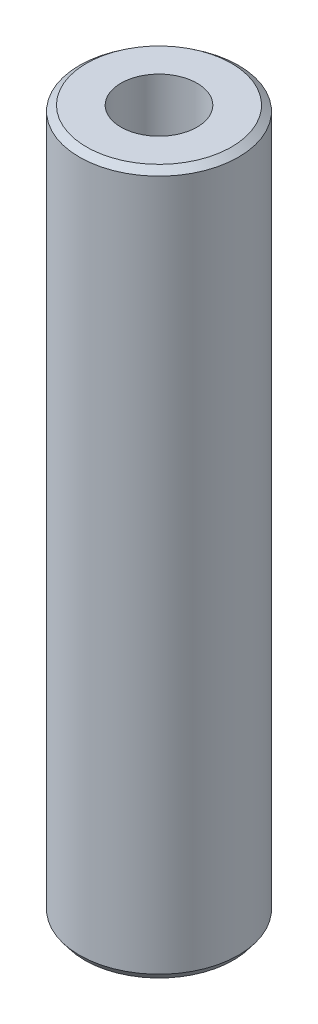
ISO-10303-21;
HEADER;
FILE_DESCRIPTION(('STEP AP214'),'2;1');
FILE_NAME('part.step','',(''),(''),'','','');
FILE_SCHEMA(('AUTOMOTIVE_DESIGN { 1 0 10303 214 1 1 1 1 }'));
ENDSEC;
DATA;
#1=APPLICATION_CONTEXT('core data for automotive mechanical design processes');
#2=APPLICATION_PROTOCOL_DEFINITION('international standard','automotive_design',2000,#1);
#3=PRODUCT_CONTEXT('',#1,'mechanical');
#4=PRODUCT('Part','Part','',(#3));
#5=PRODUCT_RELATED_PRODUCT_CATEGORY('part','',(#4));
#6=PRODUCT_DEFINITION_FORMATION('','',#4);
#7=PRODUCT_DEFINITION_CONTEXT('part definition',#1,'design');
#8=PRODUCT_DEFINITION('design','',#6,#7);
#9=PRODUCT_DEFINITION_SHAPE('','',#8);
#10=(LENGTH_UNIT() NAMED_UNIT(*) SI_UNIT(.MILLI.,.METRE.));
#11=(NAMED_UNIT(*) PLANE_ANGLE_UNIT() SI_UNIT($,.RADIAN.));
#12=(NAMED_UNIT(*) SI_UNIT($,.STERADIAN.) SOLID_ANGLE_UNIT());
#13=UNCERTAINTY_MEASURE_WITH_UNIT(LENGTH_MEASURE(1.E-05),#10,'distance_accuracy_value','');
#14=(GEOMETRIC_REPRESENTATION_CONTEXT(3) GLOBAL_UNCERTAINTY_ASSIGNED_CONTEXT((#13)) GLOBAL_UNIT_ASSIGNED_CONTEXT((#10,
#11,#12)) REPRESENTATION_CONTEXT('',''));
#15=CARTESIAN_POINT('',(0.,0.,0.));
#16=DIRECTION('',(0.,0.,1.));
#17=DIRECTION('',(1.,0.,0.));
#18=AXIS2_PLACEMENT_3D('',#15,#16,#17);
#19=CARTESIAN_POINT('',(0.,508.532402308355,0.));
#20=DIRECTION('',(0.,-1.,0.));
#21=DIRECTION('',(0.,0.,-1.));
#22=AXIS2_PLACEMENT_3D('',#19,#20,#21);
#23=CYLINDRICAL_SURFACE('',#22,57.5);
#24=CARTESIAN_POINT('',(0.,504.717653119941,0.));
#25=DIRECTION('',(0.,1.,0.));
#26=DIRECTION('',(0.,0.,1.));
#27=AXIS2_PLACEMENT_3D('',#24,#25,#26);
#28=CIRCLE('',#27,57.5);
#29=CARTESIAN_POINT('',(0.,504.717653119941,-57.5000000000001));
#30=VERTEX_POINT('',#29);
#31=EDGE_CURVE('E50',#30,#30,#28,.F.);
#32=ORIENTED_EDGE('',*,*,#31,.T.);
#33=EDGE_LOOP('',(#32));
#34=FACE_BOUND('',#33,.T.);
#35=CARTESIAN_POINT('',(0.,5.07228800096171,0.));
#36=DIRECTION('',(0.,1.,0.));
#37=DIRECTION('',(0.,0.,1.));
#38=AXIS2_PLACEMENT_3D('',#35,#36,#37);
#39=CIRCLE('',#38,57.5);
#40=CARTESIAN_POINT('',(0.,5.07228800096171,57.5));
#41=VERTEX_POINT('',#40);
#42=EDGE_CURVE('E51',#41,#41,#39,.T.);
#43=ORIENTED_EDGE('',*,*,#42,.T.);
#44=EDGE_LOOP('',(#43));
#45=FACE_BOUND('',#44,.T.);
#46=ADVANCED_FACE('F39',(#34,#45),#23,.T.);
#47=CARTESIAN_POINT('',(0.,508.532402308355,0.));
#48=DIRECTION('',(0.,1.,0.));
#49=DIRECTION('',(0.,0.,1.));
#50=AXIS2_PLACEMENT_3D('',#47,#48,#49);
#51=PLANE('',#50);
#52=CARTESIAN_POINT('',(0.,508.532402308355,0.));
#53=DIRECTION('',(0.,1.,0.));
#54=DIRECTION('',(0.,0.,1.));
#55=AXIS2_PLACEMENT_3D('',#52,#53,#54);
#56=CIRCLE('',#55,52.4277119990382);
#57=CARTESIAN_POINT('',(0.,508.532402308355,-52.4277119990383));
#58=VERTEX_POINT('',#57);
#59=EDGE_CURVE('E54',#58,#58,#56,.T.);
#60=ORIENTED_EDGE('',*,*,#59,.T.);
#61=EDGE_LOOP('',(#60));
#62=FACE_BOUND('',#61,.T.);
#63=CARTESIAN_POINT('',(0.,508.532402308355,0.));
#64=DIRECTION('',(0.,1.,0.));
#65=DIRECTION('',(0.,0.,1.));
#66=AXIS2_PLACEMENT_3D('',#63,#64,#65);
#67=CIRCLE('',#66,27.5376309982399);
#68=CARTESIAN_POINT('',(0.,508.532402308355,27.5376309982399));
#69=VERTEX_POINT('',#68);
#70=EDGE_CURVE('E58',#69,#69,#67,.T.);
#71=ORIENTED_EDGE('',*,*,#70,.F.);
#72=EDGE_LOOP('',(#71));
#73=FACE_BOUND('',#72,.T.);
#74=ADVANCED_FACE('F69',(#62,#73),#51,.T.);
#75=CARTESIAN_POINT('',(0.,0.,0.));
#76=DIRECTION('',(0.,1.,0.));
#77=DIRECTION('',(0.,0.,1.));
#78=AXIS2_PLACEMENT_3D('',#75,#76,#77);
#79=PLANE('',#78);
#80=CARTESIAN_POINT('',(0.,0.,0.));
#81=DIRECTION('',(0.,1.,0.));
#82=DIRECTION('',(0.,0.,1.));
#83=AXIS2_PLACEMENT_3D('',#80,#81,#82);
#84=CIRCLE('',#83,53.6852508115863);
#85=CARTESIAN_POINT('',(0.,0.,53.6852508115863));
#86=VERTEX_POINT('',#85);
#87=EDGE_CURVE('E10',#86,#86,#84,.F.);
#88=ORIENTED_EDGE('',*,*,#87,.T.);
#89=EDGE_LOOP('',(#88));
#90=FACE_BOUND('',#89,.T.);
#91=CARTESIAN_POINT('',(0.,0.,0.));
#92=DIRECTION('',(0.,1.,0.));
#93=DIRECTION('',(0.,0.,1.));
#94=AXIS2_PLACEMENT_3D('',#91,#92,#93);
#95=CIRCLE('',#94,27.5376309982399);
#96=CARTESIAN_POINT('',(0.,0.,27.5376309982399));
#97=VERTEX_POINT('',#96);
#98=EDGE_CURVE('E63',#97,#97,#95,.T.);
#99=ORIENTED_EDGE('',*,*,#98,.T.);
#100=EDGE_LOOP('',(#99));
#101=FACE_BOUND('',#100,.T.);
#102=ADVANCED_FACE('F75',(#90,#101),#79,.F.);
#103=CARTESIAN_POINT('',(0.,508.532402308355,0.));
#104=DIRECTION('',(0.,-1.,0.));
#105=DIRECTION('',(0.,0.,-1.));
#106=AXIS2_PLACEMENT_3D('',#103,#104,#105);
#107=CYLINDRICAL_SURFACE('',#106,27.5376309982399);
#108=ORIENTED_EDGE('',*,*,#70,.T.);
#109=EDGE_LOOP('',(#108));
#110=FACE_BOUND('',#109,.T.);
#111=ORIENTED_EDGE('',*,*,#98,.F.);
#112=EDGE_LOOP('',(#111));
#113=FACE_BOUND('',#112,.T.);
#114=ADVANCED_FACE('F70',(#110,#113),#107,.F.);
#115=CARTESIAN_POINT('',(0.,508.532402308355,0.));
#116=DIRECTION('',(0.,-1.,0.));
#117=DIRECTION('',(0.,0.,-1.));
#118=AXIS2_PLACEMENT_3D('',#115,#116,#117);
#119=CONICAL_SURFACE('',#118,52.4277119990382,0.925967508818698);
#120=CARTESIAN_POINT('',(0.,504.717653119941,-57.5000000000001));
#121=CARTESIAN_POINT('',(0.,504.757390090654,-57.4471636666567));
#122=CARTESIAN_POINT('',(0.,504.797127061367,-57.3943273333134));
#123=CARTESIAN_POINT('',(0.,504.876601002792,-57.2886546666267));
#124=CARTESIAN_POINT('',(0.,504.916337973505,-57.2358183332833));
#125=CARTESIAN_POINT('',(0.,504.99581191493,-57.1301456665966));
#126=CARTESIAN_POINT('',(0.,505.035548885643,-57.0773093332533));
#127=CARTESIAN_POINT('',(0.,505.115022827068,-56.9716366665666));
#128=CARTESIAN_POINT('',(0.,505.15475979778,-56.9188003332232));
#129=CARTESIAN_POINT('',(0.,505.234233739206,-56.8131276665365));
#130=CARTESIAN_POINT('',(0.,505.273970709918,-56.7602913331932));
#131=CARTESIAN_POINT('',(0.,505.353444651344,-56.6546186665064));
#132=CARTESIAN_POINT('',(0.,505.393181622056,-56.6017823331631));
#133=CARTESIAN_POINT('',(0.,505.472655563482,-56.4961096664764));
#134=CARTESIAN_POINT('',(0.,505.512392534194,-56.443273333133));
#135=CARTESIAN_POINT('',(0.,505.59186647562,-56.3376006664463));
#136=CARTESIAN_POINT('',(0.,505.631603446332,-56.284764333103));
#137=CARTESIAN_POINT('',(0.,505.711077387758,-56.1790916664163));
#138=CARTESIAN_POINT('',(0.,505.75081435847,-56.1262553330729));
#139=CARTESIAN_POINT('',(0.,505.830288299896,-56.0205826663862));
#140=CARTESIAN_POINT('',(0.,505.870025270608,-55.9677463330429));
#141=CARTESIAN_POINT('',(0.,505.949499212033,-55.8620736663562));
#142=CARTESIAN_POINT('',(0.,505.989236182746,-55.8092373330128));
#143=CARTESIAN_POINT('',(0.,506.068710124171,-55.7035646663261));
#144=CARTESIAN_POINT('',(0.,506.108447094884,-55.6507283329827));
#145=CARTESIAN_POINT('',(0.,506.187921036309,-55.545055666296));
#146=CARTESIAN_POINT('',(0.,506.227658007022,-55.4922193329527));
#147=CARTESIAN_POINT('',(0.,506.307131948447,-55.386546666266));
#148=CARTESIAN_POINT('',(0.,506.34686891916,-55.3337103329226));
#149=CARTESIAN_POINT('',(0.,506.426342860585,-55.2280376662359));
#150=CARTESIAN_POINT('',(0.,506.466079831298,-55.1752013328926));
#151=CARTESIAN_POINT('',(0.,506.545553772723,-55.0695286662059));
#152=CARTESIAN_POINT('',(0.,506.585290743436,-55.0166923328625));
#153=CARTESIAN_POINT('',(0.,506.664764684861,-54.9110196661758));
#154=CARTESIAN_POINT('',(0.,506.704501655574,-54.8581833328325));
#155=CARTESIAN_POINT('',(0.,506.783975596999,-54.7525106661457));
#156=CARTESIAN_POINT('',(0.,506.823712567712,-54.6996743328024));
#157=CARTESIAN_POINT('',(0.,506.903186509137,-54.5940016661157));
#158=CARTESIAN_POINT('',(0.,506.942923479849,-54.5411653327723));
#159=CARTESIAN_POINT('',(0.,507.022397421275,-54.4354926660856));
#160=CARTESIAN_POINT('',(0.,507.062134391987,-54.3826563327423));
#161=CARTESIAN_POINT('',(0.,507.141608333413,-54.2769836660556));
#162=CARTESIAN_POINT('',(0.,507.181345304125,-54.2241473327122));
#163=CARTESIAN_POINT('',(0.,507.260819245551,-54.1184746660255));
#164=CARTESIAN_POINT('',(0.,507.300556216263,-54.0656383326822));
#165=CARTESIAN_POINT('',(0.,507.380030157689,-53.9599656659955));
#166=CARTESIAN_POINT('',(0.,507.419767128401,-53.9071293326521));
#167=CARTESIAN_POINT('',(0.,507.499241069827,-53.8014566659654));
#168=CARTESIAN_POINT('',(0.,507.538978040539,-53.7486203326221));
#169=CARTESIAN_POINT('',(0.,507.618451981965,-53.6429476659354));
#170=CARTESIAN_POINT('',(0.,507.658188952677,-53.590111332592));
#171=CARTESIAN_POINT('',(0.,507.737662894102,-53.4844386659053));
#172=CARTESIAN_POINT('',(0.,507.777399864815,-53.431602332562));
#173=CARTESIAN_POINT('',(0.,507.85687380624,-53.3259296658752));
#174=CARTESIAN_POINT('',(0.,507.896610776953,-53.2730933325319));
#175=CARTESIAN_POINT('',(0.,507.976084718378,-53.1674206658452));
#176=CARTESIAN_POINT('',(0.,508.015821689091,-53.1145843325018));
#177=CARTESIAN_POINT('',(0.,508.095295630516,-53.0089116658151));
#178=CARTESIAN_POINT('',(0.,508.135032601229,-52.9560753324718));
#179=CARTESIAN_POINT('',(0.,508.214506542654,-52.8504026657851));
#180=CARTESIAN_POINT('',(0.,508.254243513367,-52.7975663324417));
#181=CARTESIAN_POINT('',(0.,508.333717454792,-52.691893665755));
#182=CARTESIAN_POINT('',(0.,508.373454425505,-52.6390573324117));
#183=CARTESIAN_POINT('',(0.,508.45292836693,-52.533384665725));
#184=CARTESIAN_POINT('',(0.,508.492665337643,-52.4805483323816));
#185=CARTESIAN_POINT('',(0.,508.532402308355,-52.4277119990383));
#186=B_SPLINE_CURVE_WITH_KNOTS('',3,(#120,#121,#122,#123,#124,#125,#126,#127,#128,#129,#130,
#131,#132,#133,#134,#135,#136,#137,#138,#139,#140,#141,#142,#143,#144,#145,#146,#147,#148,#149,
#150,#151,#152,#153,#154,#155,#156,#157,#158,#159,#160,#161,#162,#163,#164,#165,#166,#167,#168,
#169,#170,#171,#172,#173,#174,#175,#176,#177,#178,#179,#180,#181,#182,#183,#184,#185),
.UNSPECIFIED.,.F.,.F.,(4,2,2,2,2,2,2,2,2,2,2,2,2,2,2,2,2,2,2,2,2,2,2,2,2,2,2,2,2,2,2,2,4),(0.,
0.198333922119407,0.396667844238875,0.595001766358348,0.793335688477816,0.99166961059729,
1.1900035327167,1.38833745483616,1.58667137695564,1.78500529907511,1.98333922119458,
2.18167314331398,2.38000706543345,2.57834098755292,2.7766749096724,2.97500883179186,
3.17334275391134,3.37167667603074,3.57001059815021,3.76834452026968,3.96667844238915,
4.16501236450862,4.36334628662803,4.5616802087475,4.76001413086697,4.95834805298644,
5.15668197510591,5.35501589722532,5.55334981934479,5.75168374146426,5.95001766358373,
6.1483515857032,6.34668550782267),.UNSPECIFIED.);
#187=EDGE_CURVE('BSEAM81',#30,#58,#186,.T.);
#188=ORIENTED_EDGE('',*,*,#31,.F.);
#189=ORIENTED_EDGE('',*,*,#59,.F.);
#190=ORIENTED_EDGE('',*,*,#187,.T.);
#191=ORIENTED_EDGE('',*,*,#187,.F.);
#192=EDGE_LOOP('',(#188,#190,#189,#191));
#193=FACE_BOUND('',#192,.T.);
#194=ADVANCED_FACE('F81',(#193),#119,.T.);
#195=CARTESIAN_POINT('',(0.,5.07228800096171,0.));
#196=DIRECTION('',(0.,1.,0.));
#197=DIRECTION('',(0.,0.,1.));
#198=AXIS2_PLACEMENT_3D('',#195,#196,#197);
#199=CONICAL_SURFACE('',#198,57.5,0.644828817976183);
#200=ORIENTED_EDGE('',*,*,#87,.F.);
#201=EDGE_LOOP('',(#200));
#202=FACE_BOUND('',#201,.T.);
#203=ORIENTED_EDGE('',*,*,#42,.F.);
#204=EDGE_LOOP('',(#203));
#205=FACE_BOUND('',#204,.T.);
#206=ADVANCED_FACE('F45',(#202,#205),#199,.T.);
#207=CLOSED_SHELL('',(#46,#74,#102,#114,#194,#206));
#208=MANIFOLD_SOLID_BREP('B2',#207);
#209=ADVANCED_BREP_SHAPE_REPRESENTATION('',(#18,#208),#14);
#210=SHAPE_DEFINITION_REPRESENTATION(#9,#209);
ENDSEC;
END-ISO-10303-21;
